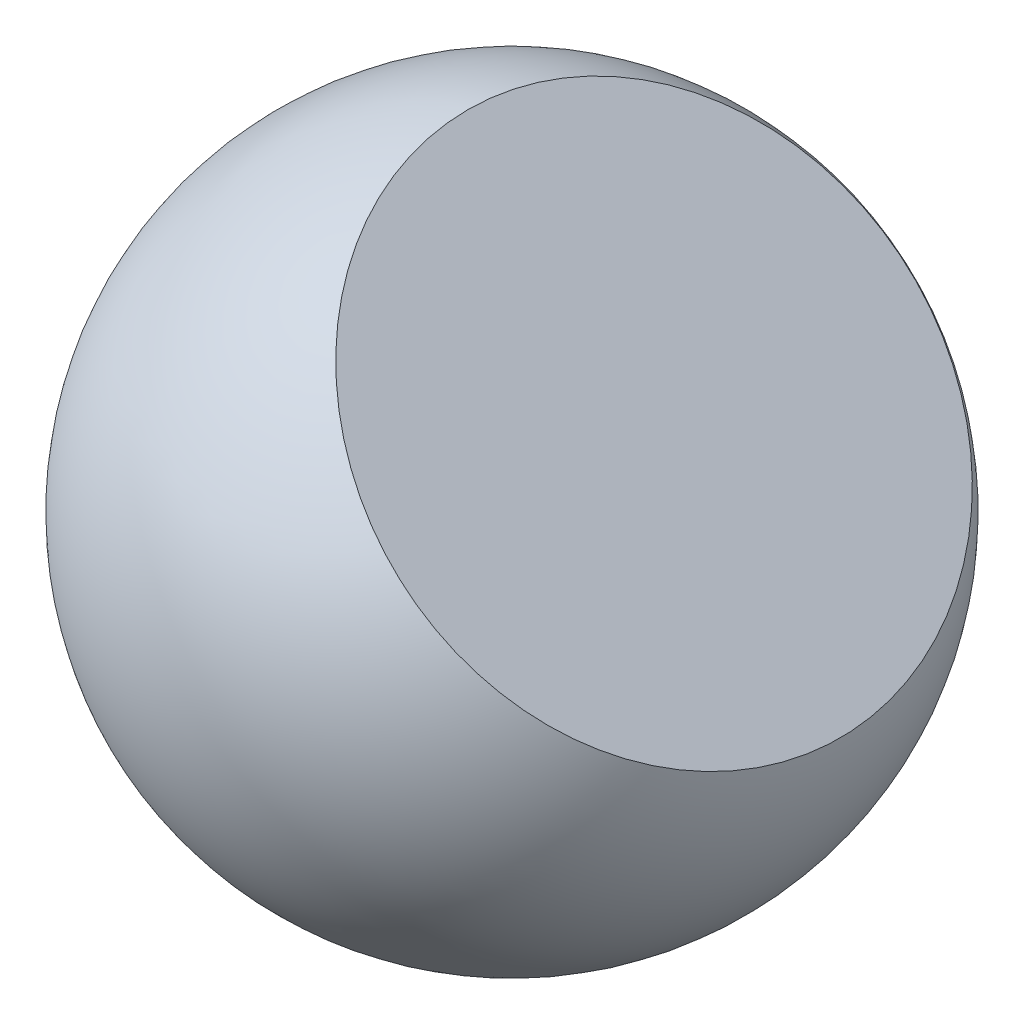
ISO-10303-21;
HEADER;
FILE_DESCRIPTION(('STEP AP214'),'2;1');
FILE_NAME('part.step','',(''),(''),'','','');
FILE_SCHEMA(('AUTOMOTIVE_DESIGN { 1 0 10303 214 1 1 1 1 }'));
ENDSEC;
DATA;
#1=APPLICATION_CONTEXT('core data for automotive mechanical design processes');
#2=APPLICATION_PROTOCOL_DEFINITION('international standard','automotive_design',2000,#1);
#3=PRODUCT_CONTEXT('',#1,'mechanical');
#4=PRODUCT('Part','Part','',(#3));
#5=PRODUCT_RELATED_PRODUCT_CATEGORY('part','',(#4));
#6=PRODUCT_DEFINITION_FORMATION('','',#4);
#7=PRODUCT_DEFINITION_CONTEXT('part definition',#1,'design');
#8=PRODUCT_DEFINITION('design','',#6,#7);
#9=PRODUCT_DEFINITION_SHAPE('','',#8);
#10=(LENGTH_UNIT() NAMED_UNIT(*) SI_UNIT(.MILLI.,.METRE.));
#11=(NAMED_UNIT(*) PLANE_ANGLE_UNIT() SI_UNIT($,.RADIAN.));
#12=(NAMED_UNIT(*) SI_UNIT($,.STERADIAN.) SOLID_ANGLE_UNIT());
#13=UNCERTAINTY_MEASURE_WITH_UNIT(LENGTH_MEASURE(1.E-05),#10,'distance_accuracy_value','');
#14=(GEOMETRIC_REPRESENTATION_CONTEXT(3) GLOBAL_UNCERTAINTY_ASSIGNED_CONTEXT((#13)) GLOBAL_UNIT_ASSIGNED_CONTEXT((#10,
#11,#12)) REPRESENTATION_CONTEXT('',''));
#15=CARTESIAN_POINT('',(0.,0.,0.));
#16=DIRECTION('',(0.,0.,1.));
#17=DIRECTION('',(1.,0.,0.));
#18=AXIS2_PLACEMENT_3D('',#15,#16,#17);
#19=CARTESIAN_POINT('',(0.,0.,0.));
#20=DIRECTION('',(-1.,0.,0.));
#21=DIRECTION('',(0.,0.,-1.));
#22=AXIS2_PLACEMENT_3D('',#19,#20,#21);
#23=SPHERICAL_SURFACE('',#22,381.);
#24=CARTESIAN_POINT('',(0.,0.,0.));
#25=DIRECTION('',(0.69354709763802,0.720411287639136,0.));
#26=DIRECTION('',(-0.720411287639136,0.69354709763802,0.));
#27=AXIS2_PLACEMENT_3D('',#24,#25,#26);
#28=SPHERICAL_SURFACE('',#27,381.);
#29=CARTESIAN_POINT('',(164.227634794267,170.588907733873,0.));
#30=DIRECTION('',(0.69354709763802,0.720411287639136,0.));
#31=DIRECTION('',(-0.720411287639136,0.69354709763802,0.));
#32=AXIS2_PLACEMENT_3D('',#29,#30,#31);
#33=CIRCLE('',#32,298.478991770015);
#34=CARTESIAN_POINT('',(-50.8000000000002,377.59814618189,0.));
#35=VERTEX_POINT('',#34);
#36=EDGE_CURVE('E11',#35,#35,#33,.T.);
#37=ORIENTED_EDGE('',*,*,#36,.F.);
#38=EDGE_LOOP('',(#37));
#39=FACE_BOUND('',#38,.T.);
#40=ADVANCED_FACE('F25',(#39),#28,.T.);
#41=CARTESIAN_POINT('',(164.227634794267,170.588907733873,0.));
#42=DIRECTION('',(0.69354709763802,0.720411287639136,0.));
#43=DIRECTION('',(-0.720411287639136,0.69354709763802,0.));
#44=AXIS2_PLACEMENT_3D('',#41,#42,#43);
#45=PLANE('',#44);
#46=ORIENTED_EDGE('',*,*,#36,.T.);
#47=EDGE_LOOP('',(#46));
#48=FACE_BOUND('',#47,.T.);
#49=ADVANCED_FACE('F32',(#48),#45,.T.);
#50=CLOSED_SHELL('',(#40,#49));
#51=MANIFOLD_SOLID_BREP('B2',#50);
#52=ADVANCED_BREP_SHAPE_REPRESENTATION('',(#18,#51),#14);
#53=SHAPE_DEFINITION_REPRESENTATION(#9,#52);
ENDSEC;
END-ISO-10303-21;
